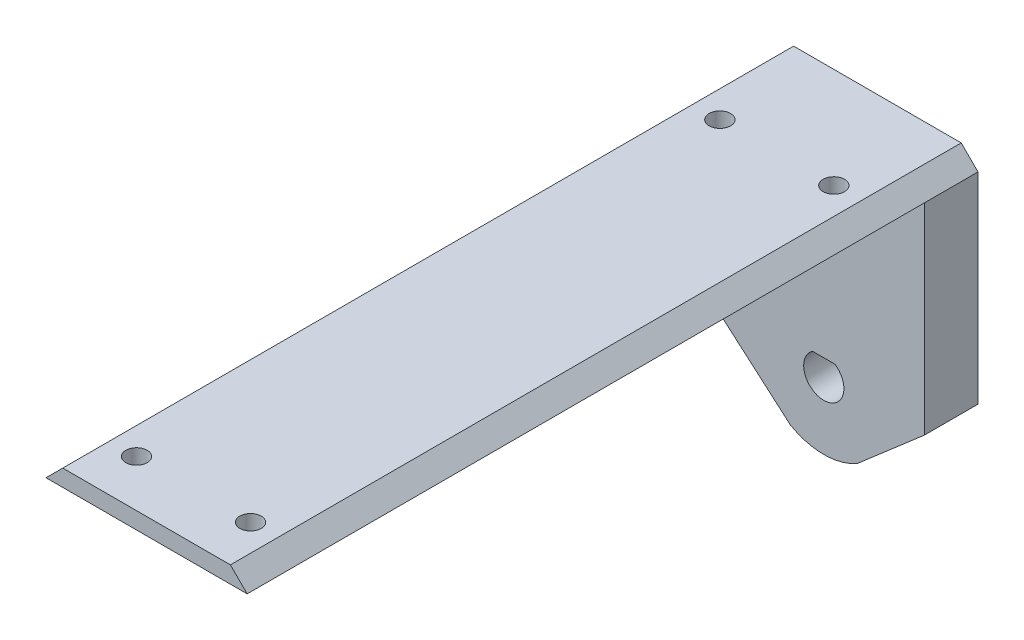
ISO-10303-21;
HEADER;
FILE_DESCRIPTION(('STEP AP214'),'2;1');
FILE_NAME('part.step','',(''),(''),'','','');
FILE_SCHEMA(('AUTOMOTIVE_DESIGN { 1 0 10303 214 1 1 1 1 }'));
ENDSEC;
DATA;
#1=APPLICATION_CONTEXT('core data for automotive mechanical design processes');
#2=APPLICATION_PROTOCOL_DEFINITION('international standard','automotive_design',2000,#1);
#3=PRODUCT_CONTEXT('',#1,'mechanical');
#4=PRODUCT('Part','Part','',(#3));
#5=PRODUCT_RELATED_PRODUCT_CATEGORY('part','',(#4));
#6=PRODUCT_DEFINITION_FORMATION('','',#4);
#7=PRODUCT_DEFINITION_CONTEXT('part definition',#1,'design');
#8=PRODUCT_DEFINITION('design','',#6,#7);
#9=PRODUCT_DEFINITION_SHAPE('','',#8);
#10=(LENGTH_UNIT() NAMED_UNIT(*) SI_UNIT(.MILLI.,.METRE.));
#11=(NAMED_UNIT(*) PLANE_ANGLE_UNIT() SI_UNIT($,.RADIAN.));
#12=(NAMED_UNIT(*) SI_UNIT($,.STERADIAN.) SOLID_ANGLE_UNIT());
#13=UNCERTAINTY_MEASURE_WITH_UNIT(LENGTH_MEASURE(1.E-05),#10,'distance_accuracy_value','');
#14=(GEOMETRIC_REPRESENTATION_CONTEXT(3) GLOBAL_UNCERTAINTY_ASSIGNED_CONTEXT((#13)) GLOBAL_UNIT_ASSIGNED_CONTEXT((#10,
#11,#12)) REPRESENTATION_CONTEXT('',''));
#15=CARTESIAN_POINT('',(0.,0.,0.));
#16=DIRECTION('',(0.,0.,1.));
#17=DIRECTION('',(1.,0.,0.));
#18=AXIS2_PLACEMENT_3D('',#15,#16,#17);
#19=CARTESIAN_POINT('',(0.,-7.,8.));
#20=DIRECTION('',(0.,0.,-1.));
#21=DIRECTION('',(-1.,0.,0.));
#22=AXIS2_PLACEMENT_3D('',#19,#20,#21);
#23=CYLINDRICAL_SURFACE('',#22,3.);
#24=CARTESIAN_POINT('',(0.,-7.,0.));
#25=DIRECTION('',(0.,0.,1.));
#26=DIRECTION('',(1.,0.,0.));
#27=AXIS2_PLACEMENT_3D('',#24,#25,#26);
#28=CIRCLE('',#27,3.);
#29=CARTESIAN_POINT('',(-1.6583123951777,-4.5,0.));
#30=VERTEX_POINT('',#29);
#31=CARTESIAN_POINT('',(1.6583123951777,-4.5,0.));
#32=VERTEX_POINT('',#31);
#33=EDGE_CURVE('E146',#30,#32,#28,.T.);
#34=ORIENTED_EDGE('',*,*,#33,.F.);
#35=DIRECTION('',(0.,0.,-1.));
#36=VECTOR('',#35,1.);
#37=CARTESIAN_POINT('',(-1.6583123951777,-4.5,8.));
#38=LINE('',#37,#36);
#39=CARTESIAN_POINT('',(-1.6583123951777,-4.5,8.));
#40=VERTEX_POINT('',#39);
#41=EDGE_CURVE('E11',#40,#30,#38,.T.);
#42=ORIENTED_EDGE('',*,*,#41,.F.);
#43=CARTESIAN_POINT('',(0.,-7.,8.));
#44=DIRECTION('',(0.,0.,1.));
#45=DIRECTION('',(1.,0.,0.));
#46=AXIS2_PLACEMENT_3D('',#43,#44,#45);
#47=CIRCLE('',#46,3.);
#48=CARTESIAN_POINT('',(1.6583123951777,-4.5,8.));
#49=VERTEX_POINT('',#48);
#50=EDGE_CURVE('E123',#40,#49,#47,.T.);
#51=ORIENTED_EDGE('',*,*,#50,.T.);
#52=DIRECTION('',(0.,0.,-1.));
#53=VECTOR('',#52,1.);
#54=CARTESIAN_POINT('',(1.6583123951777,-4.5,8.));
#55=LINE('',#54,#53);
#56=EDGE_CURVE('E46',#49,#32,#55,.T.);
#57=ORIENTED_EDGE('',*,*,#56,.T.);
#58=EDGE_LOOP('',(#34,#42,#51,#57));
#59=FACE_BOUND('',#58,.T.);
#60=ADVANCED_FACE('F36',(#59),#23,.F.);
#61=CARTESIAN_POINT('',(0.,-7.,8.));
#62=DIRECTION('',(0.,0.,-1.));
#63=DIRECTION('',(-1.,0.,0.));
#64=AXIS2_PLACEMENT_3D('',#61,#62,#63);
#65=CYLINDRICAL_SURFACE('',#64,10.);
#66=CARTESIAN_POINT('',(0.,-7.,0.));
#67=DIRECTION('',(0.,0.,1.));
#68=DIRECTION('',(1.,0.,0.));
#69=AXIS2_PLACEMENT_3D('',#66,#67,#68);
#70=CIRCLE('',#69,10.);
#71=CARTESIAN_POINT('',(5.,-15.6602540378444,0.));
#72=VERTEX_POINT('',#71);
#73=CARTESIAN_POINT('',(-5.,-15.6602540378444,0.));
#74=VERTEX_POINT('',#73);
#75=EDGE_CURVE('E133',#72,#74,#70,.F.);
#76=ORIENTED_EDGE('',*,*,#75,.F.);
#77=DIRECTION('',(0.,0.,-1.));
#78=VECTOR('',#77,1.);
#79=CARTESIAN_POINT('',(5.,-15.6602540378444,8.));
#80=LINE('',#79,#78);
#81=CARTESIAN_POINT('',(5.,-15.6602540378444,8.));
#82=VERTEX_POINT('',#81);
#83=EDGE_CURVE('E84',#82,#72,#80,.T.);
#84=ORIENTED_EDGE('',*,*,#83,.F.);
#85=CARTESIAN_POINT('',(0.,-7.,8.));
#86=DIRECTION('',(0.,0.,1.));
#87=DIRECTION('',(1.,0.,0.));
#88=AXIS2_PLACEMENT_3D('',#85,#86,#87);
#89=CIRCLE('',#88,10.);
#90=CARTESIAN_POINT('',(-5.,-15.6602540378444,8.));
#91=VERTEX_POINT('',#90);
#92=EDGE_CURVE('E110',#82,#91,#89,.F.);
#93=ORIENTED_EDGE('',*,*,#92,.T.);
#94=DIRECTION('',(0.,0.,-1.));
#95=VECTOR('',#94,1.);
#96=CARTESIAN_POINT('',(-5.,-15.6602540378444,8.));
#97=LINE('',#96,#95);
#98=EDGE_CURVE('E100',#91,#74,#97,.T.);
#99=ORIENTED_EDGE('',*,*,#98,.T.);
#100=EDGE_LOOP('',(#76,#84,#93,#99));
#101=FACE_BOUND('',#100,.T.);
#102=ADVANCED_FACE('F38',(#101),#65,.T.);
#103=CARTESIAN_POINT('',(9.89267304370918,-11.4230748895809,8.));
#104=DIRECTION('',(0.654653670707977,-0.755928946018455,0.));
#105=DIRECTION('',(0.755928946018455,0.654653670707977,0.));
#106=AXIS2_PLACEMENT_3D('',#103,#104,#105);
#107=PLANE('',#106);
#108=DIRECTION('',(-0.755928946018455,-0.654653670707977,0.));
#109=VECTOR('',#108,1.);
#110=CARTESIAN_POINT('',(9.89267304370918,-11.4230748895809,0.));
#111=LINE('',#110,#109);
#112=CARTESIAN_POINT('',(15.,-7.,0.));
#113=VERTEX_POINT('',#112);
#114=EDGE_CURVE('E135',#113,#72,#111,.T.);
#115=ORIENTED_EDGE('',*,*,#114,.F.);
#116=DIRECTION('',(0.,0.,-1.));
#117=VECTOR('',#116,1.);
#118=CARTESIAN_POINT('',(15.,-7.,8.));
#119=LINE('',#118,#117);
#120=CARTESIAN_POINT('',(15.,-7.,8.));
#121=VERTEX_POINT('',#120);
#122=EDGE_CURVE('E153',#121,#113,#119,.T.);
#123=ORIENTED_EDGE('',*,*,#122,.F.);
#124=DIRECTION('',(-0.755928946018455,-0.654653670707977,0.));
#125=VECTOR('',#124,1.);
#126=CARTESIAN_POINT('',(9.89267304370918,-11.4230748895809,8.));
#127=LINE('',#126,#125);
#128=EDGE_CURVE('E114',#121,#82,#127,.T.);
#129=ORIENTED_EDGE('',*,*,#128,.T.);
#130=ORIENTED_EDGE('',*,*,#83,.T.);
#131=EDGE_LOOP('',(#115,#123,#129,#130));
#132=FACE_BOUND('',#131,.T.);
#133=ADVANCED_FACE('F232',(#132),#107,.T.);
#134=CARTESIAN_POINT('',(15.,0.,8.));
#135=DIRECTION('',(-1.,0.,0.));
#136=DIRECTION('',(0.,0.,1.));
#137=AXIS2_PLACEMENT_3D('',#134,#135,#136);
#138=PLANE('',#137);
#139=DIRECTION('',(0.,1.,0.));
#140=VECTOR('',#139,1.);
#141=CARTESIAN_POINT('',(15.,0.,0.));
#142=LINE('',#141,#140);
#143=CARTESIAN_POINT('',(15.,23.,0.));
#144=VERTEX_POINT('',#143);
#145=EDGE_CURVE('E139',#113,#144,#142,.T.);
#146=ORIENTED_EDGE('',*,*,#145,.T.);
#147=DIRECTION('',(0.,0.,-1.));
#148=VECTOR('',#147,1.);
#149=CARTESIAN_POINT('',(15.,23.,8.));
#150=LINE('',#149,#148);
#151=CARTESIAN_POINT('',(15.,23.,7.99999999999999));
#152=VERTEX_POINT('',#151);
#153=EDGE_CURVE('E155',#152,#144,#150,.T.);
#154=ORIENTED_EDGE('',*,*,#153,.F.);
#155=DIRECTION('',(0.,1.,0.));
#156=VECTOR('',#155,1.);
#157=CARTESIAN_POINT('',(15.,0.,8.));
#158=LINE('',#157,#156);
#159=EDGE_CURVE('E158',#121,#152,#158,.T.);
#160=ORIENTED_EDGE('',*,*,#159,.F.);
#161=ORIENTED_EDGE('',*,*,#122,.T.);
#162=EDGE_LOOP('',(#146,#154,#160,#161));
#163=FACE_BOUND('',#162,.T.);
#164=ADVANCED_FACE('F238',(#163),#138,.F.);
#165=CARTESIAN_POINT('',(-15.,0.,8.));
#166=DIRECTION('',(-1.,0.,0.));
#167=DIRECTION('',(0.,0.,1.));
#168=AXIS2_PLACEMENT_3D('',#165,#166,#167);
#169=PLANE('',#168);
#170=DIRECTION('',(0.,1.,0.));
#171=VECTOR('',#170,1.);
#172=CARTESIAN_POINT('',(-15.,0.,0.));
#173=LINE('',#172,#171);
#174=CARTESIAN_POINT('',(-15.,-7.,0.));
#175=VERTEX_POINT('',#174);
#176=CARTESIAN_POINT('',(-15.,23.,0.));
#177=VERTEX_POINT('',#176);
#178=EDGE_CURVE('E142',#175,#177,#173,.T.);
#179=ORIENTED_EDGE('',*,*,#178,.F.);
#180=DIRECTION('',(0.,0.,-1.));
#181=VECTOR('',#180,1.);
#182=CARTESIAN_POINT('',(-15.,-7.,8.));
#183=LINE('',#182,#181);
#184=CARTESIAN_POINT('',(-15.,-7.,8.));
#185=VERTEX_POINT('',#184);
#186=EDGE_CURVE('E107',#185,#175,#183,.T.);
#187=ORIENTED_EDGE('',*,*,#186,.F.);
#188=DIRECTION('',(0.,1.,0.));
#189=VECTOR('',#188,1.);
#190=CARTESIAN_POINT('',(-15.,0.,8.));
#191=LINE('',#190,#189);
#192=CARTESIAN_POINT('',(-15.,23.,8.));
#193=VERTEX_POINT('',#192);
#194=EDGE_CURVE('E122',#185,#193,#191,.T.);
#195=ORIENTED_EDGE('',*,*,#194,.T.);
#196=DIRECTION('',(0.,0.,-1.));
#197=VECTOR('',#196,1.);
#198=CARTESIAN_POINT('',(-15.,23.,8.));
#199=LINE('',#198,#197);
#200=EDGE_CURVE('E152',#193,#177,#199,.T.);
#201=ORIENTED_EDGE('',*,*,#200,.T.);
#202=EDGE_LOOP('',(#179,#187,#195,#201));
#203=FACE_BOUND('',#202,.T.);
#204=ADVANCED_FACE('F304',(#203),#169,.T.);
#205=CARTESIAN_POINT('',(-9.89267304370918,-11.4230748895809,8.));
#206=DIRECTION('',(-0.654653670707977,-0.755928946018455,0.));
#207=DIRECTION('',(0.755928946018455,-0.654653670707977,0.));
#208=AXIS2_PLACEMENT_3D('',#205,#206,#207);
#209=PLANE('',#208);
#210=DIRECTION('',(-0.755928946018455,0.654653670707977,0.));
#211=VECTOR('',#210,1.);
#212=CARTESIAN_POINT('',(-9.89267304370918,-11.4230748895809,0.));
#213=LINE('',#212,#211);
#214=EDGE_CURVE('E105',#74,#175,#213,.T.);
#215=ORIENTED_EDGE('',*,*,#214,.F.);
#216=ORIENTED_EDGE('',*,*,#98,.F.);
#217=DIRECTION('',(-0.755928946018455,0.654653670707977,0.));
#218=VECTOR('',#217,1.);
#219=CARTESIAN_POINT('',(-9.89267304370918,-11.4230748895809,8.));
#220=LINE('',#219,#218);
#221=EDGE_CURVE('E103',#91,#185,#220,.T.);
#222=ORIENTED_EDGE('',*,*,#221,.T.);
#223=ORIENTED_EDGE('',*,*,#186,.T.);
#224=EDGE_LOOP('',(#215,#216,#222,#223));
#225=FACE_BOUND('',#224,.T.);
#226=ADVANCED_FACE('F101',(#225),#209,.T.);
#227=CARTESIAN_POINT('',(0.,-4.5,8.));
#228=DIRECTION('',(0.,-1.,0.));
#229=DIRECTION('',(0.,0.,-1.));
#230=AXIS2_PLACEMENT_3D('',#227,#228,#229);
#231=PLANE('',#230);
#232=DIRECTION('',(-1.,0.,0.));
#233=VECTOR('',#232,1.);
#234=CARTESIAN_POINT('',(0.,-4.5,0.));
#235=LINE('',#234,#233);
#236=EDGE_CURVE('E115',#32,#30,#235,.T.);
#237=ORIENTED_EDGE('',*,*,#236,.F.);
#238=ORIENTED_EDGE('',*,*,#56,.F.);
#239=DIRECTION('',(-1.,0.,0.));
#240=VECTOR('',#239,1.);
#241=CARTESIAN_POINT('',(0.,-4.5,8.));
#242=LINE('',#241,#240);
#243=EDGE_CURVE('E108',#49,#40,#242,.T.);
#244=ORIENTED_EDGE('',*,*,#243,.T.);
#245=ORIENTED_EDGE('',*,*,#41,.T.);
#246=EDGE_LOOP('',(#237,#238,#244,#245));
#247=FACE_BOUND('',#246,.T.);
#248=ADVANCED_FACE('F301',(#247),#231,.T.);
#249=CARTESIAN_POINT('',(0.,0.,8.));
#250=DIRECTION('',(0.,0.,1.));
#251=DIRECTION('',(1.,0.,0.));
#252=AXIS2_PLACEMENT_3D('',#249,#250,#251);
#253=PLANE('',#252);
#254=ORIENTED_EDGE('',*,*,#92,.F.);
#255=ORIENTED_EDGE('',*,*,#128,.F.);
#256=ORIENTED_EDGE('',*,*,#159,.T.);
#257=DIRECTION('',(-1.,0.,0.));
#258=VECTOR('',#257,1.);
#259=CARTESIAN_POINT('',(0.,23.,8.));
#260=LINE('',#259,#258);
#261=EDGE_CURVE('E126',#152,#193,#260,.T.);
#262=ORIENTED_EDGE('',*,*,#261,.T.);
#263=ORIENTED_EDGE('',*,*,#194,.F.);
#264=ORIENTED_EDGE('',*,*,#221,.F.);
#265=EDGE_LOOP('',(#254,#255,#256,#262,#263,#264));
#266=FACE_BOUND('',#265,.T.);
#267=ORIENTED_EDGE('',*,*,#50,.F.);
#268=ORIENTED_EDGE('',*,*,#243,.F.);
#269=EDGE_LOOP('',(#267,#268));
#270=FACE_BOUND('',#269,.T.);
#271=ADVANCED_FACE('F118',(#266,#270),#253,.T.);
#272=CARTESIAN_POINT('',(0.,0.,0.));
#273=DIRECTION('',(0.,0.,1.));
#274=DIRECTION('',(1.,0.,0.));
#275=AXIS2_PLACEMENT_3D('',#272,#273,#274);
#276=PLANE('',#275);
#277=ORIENTED_EDGE('',*,*,#75,.T.);
#278=ORIENTED_EDGE('',*,*,#214,.T.);
#279=ORIENTED_EDGE('',*,*,#178,.T.);
#280=DIRECTION('',(0.707106781186546,0.707106781186549,0.));
#281=VECTOR('',#280,1.);
#282=CARTESIAN_POINT('',(-19.,18.9999999999999,0.));
#283=LINE('',#282,#281);
#284=CARTESIAN_POINT('',(-12.5,25.5,0.));
#285=VERTEX_POINT('',#284);
#286=EDGE_CURVE('E214',#177,#285,#283,.T.);
#287=ORIENTED_EDGE('',*,*,#286,.T.);
#288=DIRECTION('',(1.,0.,0.));
#289=VECTOR('',#288,1.);
#290=CARTESIAN_POINT('',(0.,25.5,0.));
#291=LINE('',#290,#289);
#292=CARTESIAN_POINT('',(12.5,25.5,0.));
#293=VERTEX_POINT('',#292);
#294=EDGE_CURVE('E197',#285,#293,#291,.T.);
#295=ORIENTED_EDGE('',*,*,#294,.T.);
#296=DIRECTION('',(-0.707106781186552,0.707106781186543,0.));
#297=VECTOR('',#296,1.);
#298=CARTESIAN_POINT('',(18.9999999999999,19.0000000000001,0.));
#299=LINE('',#298,#297);
#300=EDGE_CURVE('E202',#144,#293,#299,.T.);
#301=ORIENTED_EDGE('',*,*,#300,.F.);
#302=ORIENTED_EDGE('',*,*,#145,.F.);
#303=ORIENTED_EDGE('',*,*,#114,.T.);
#304=EDGE_LOOP('',(#277,#278,#279,#287,#295,#301,#302,#303));
#305=FACE_BOUND('',#304,.T.);
#306=ORIENTED_EDGE('',*,*,#33,.T.);
#307=ORIENTED_EDGE('',*,*,#236,.T.);
#308=EDGE_LOOP('',(#306,#307));
#309=FACE_BOUND('',#308,.T.);
#310=ADVANCED_FACE('F251',(#305,#309),#276,.F.);
#311=CARTESIAN_POINT('',(0.,23.,109.));
#312=DIRECTION('',(0.,-1.,0.));
#313=DIRECTION('',(0.,0.,-1.));
#314=AXIS2_PLACEMENT_3D('',#311,#312,#313);
#315=PLANE('',#314);
#316=CARTESIAN_POINT('',(-8.50000000000001,23.,15.));
#317=DIRECTION('',(0.,-1.,0.));
#318=DIRECTION('',(0.,0.,-1.));
#319=AXIS2_PLACEMENT_3D('',#316,#317,#318);
#320=CIRCLE('',#319,1.59999999999999);
#321=CARTESIAN_POINT('',(-8.50000000000001,23.,13.4));
#322=VERTEX_POINT('',#321);
#323=EDGE_CURVE('E40',#322,#322,#320,.T.);
#324=ORIENTED_EDGE('',*,*,#323,.F.);
#325=EDGE_LOOP('',(#324));
#326=FACE_BOUND('',#325,.T.);
#327=CARTESIAN_POINT('',(8.49999999999998,23.,15.));
#328=DIRECTION('',(0.,-1.,0.));
#329=DIRECTION('',(0.,0.,-1.));
#330=AXIS2_PLACEMENT_3D('',#327,#328,#329);
#331=CIRCLE('',#330,1.59999999999999);
#332=CARTESIAN_POINT('',(8.49999999999998,23.,13.4));
#333=VERTEX_POINT('',#332);
#334=EDGE_CURVE('E177',#333,#333,#331,.T.);
#335=ORIENTED_EDGE('',*,*,#334,.F.);
#336=EDGE_LOOP('',(#335));
#337=FACE_BOUND('',#336,.T.);
#338=CARTESIAN_POINT('',(-8.5,23.,102.));
#339=DIRECTION('',(0.,-1.,0.));
#340=DIRECTION('',(0.,0.,-1.));
#341=AXIS2_PLACEMENT_3D('',#338,#339,#340);
#342=CIRCLE('',#341,1.59999999999999);
#343=CARTESIAN_POINT('',(-8.5,23.,100.4));
#344=VERTEX_POINT('',#343);
#345=EDGE_CURVE('E173',#344,#344,#342,.T.);
#346=ORIENTED_EDGE('',*,*,#345,.F.);
#347=EDGE_LOOP('',(#346));
#348=FACE_BOUND('',#347,.T.);
#349=CARTESIAN_POINT('',(8.49999999999998,23.,102.));
#350=DIRECTION('',(0.,-1.,0.));
#351=DIRECTION('',(0.,0.,-1.));
#352=AXIS2_PLACEMENT_3D('',#349,#350,#351);
#353=CIRCLE('',#352,1.59999999999999);
#354=CARTESIAN_POINT('',(8.49999999999998,23.,100.4));
#355=VERTEX_POINT('',#354);
#356=EDGE_CURVE('E194',#355,#355,#353,.T.);
#357=ORIENTED_EDGE('',*,*,#356,.F.);
#358=EDGE_LOOP('',(#357));
#359=FACE_BOUND('',#358,.T.);
#360=ORIENTED_EDGE('',*,*,#261,.F.);
#361=DIRECTION('',(0.,0.,-1.));
#362=VECTOR('',#361,1.);
#363=CARTESIAN_POINT('',(15.,23.,109.));
#364=LINE('',#363,#362);
#365=CARTESIAN_POINT('',(15.,23.,109.));
#366=VERTEX_POINT('',#365);
#367=EDGE_CURVE('E221',#366,#152,#364,.T.);
#368=ORIENTED_EDGE('',*,*,#367,.F.);
#369=DIRECTION('',(-1.,0.,0.));
#370=VECTOR('',#369,1.);
#371=CARTESIAN_POINT('',(0.,23.,109.));
#372=LINE('',#371,#370);
#373=CARTESIAN_POINT('',(-15.,23.,109.));
#374=VERTEX_POINT('',#373);
#375=EDGE_CURVE('E205',#366,#374,#372,.T.);
#376=ORIENTED_EDGE('',*,*,#375,.T.);
#377=DIRECTION('',(0.,0.,-1.));
#378=VECTOR('',#377,1.);
#379=CARTESIAN_POINT('',(-15.,23.,109.));
#380=LINE('',#379,#378);
#381=EDGE_CURVE('E229',#374,#193,#380,.T.);
#382=ORIENTED_EDGE('',*,*,#381,.T.);
#383=EDGE_LOOP('',(#360,#368,#376,#382));
#384=FACE_BOUND('',#383,.T.);
#385=ADVANCED_FACE('F279',(#326,#337,#348,#359,#384),#315,.T.);
#386=CARTESIAN_POINT('',(0.,25.5,109.));
#387=DIRECTION('',(0.,1.,0.));
#388=DIRECTION('',(0.,0.,1.));
#389=AXIS2_PLACEMENT_3D('',#386,#387,#388);
#390=PLANE('',#389);
#391=CARTESIAN_POINT('',(-8.50000000000001,25.5,15.));
#392=DIRECTION('',(0.,1.,0.));
#393=DIRECTION('',(0.,0.,1.));
#394=AXIS2_PLACEMENT_3D('',#391,#392,#393);
#395=CIRCLE('',#394,1.59999999999999);
#396=CARTESIAN_POINT('',(-8.50000000000001,25.5,16.6));
#397=VERTEX_POINT('',#396);
#398=EDGE_CURVE('E189',#397,#397,#395,.T.);
#399=ORIENTED_EDGE('',*,*,#398,.F.);
#400=EDGE_LOOP('',(#399));
#401=FACE_BOUND('',#400,.T.);
#402=CARTESIAN_POINT('',(8.49999999999998,25.5,15.));
#403=DIRECTION('',(0.,1.,0.));
#404=DIRECTION('',(0.,0.,1.));
#405=AXIS2_PLACEMENT_3D('',#402,#403,#404);
#406=CIRCLE('',#405,1.59999999999999);
#407=CARTESIAN_POINT('',(8.49999999999998,25.5,16.6));
#408=VERTEX_POINT('',#407);
#409=EDGE_CURVE('E179',#408,#408,#406,.T.);
#410=ORIENTED_EDGE('',*,*,#409,.F.);
#411=EDGE_LOOP('',(#410));
#412=FACE_BOUND('',#411,.T.);
#413=CARTESIAN_POINT('',(-8.5,25.5,102.));
#414=DIRECTION('',(0.,1.,0.));
#415=DIRECTION('',(0.,0.,1.));
#416=AXIS2_PLACEMENT_3D('',#413,#414,#415);
#417=CIRCLE('',#416,1.59999999999999);
#418=CARTESIAN_POINT('',(-8.5,25.5,103.6));
#419=VERTEX_POINT('',#418);
#420=EDGE_CURVE('E176',#419,#419,#417,.T.);
#421=ORIENTED_EDGE('',*,*,#420,.F.);
#422=EDGE_LOOP('',(#421));
#423=FACE_BOUND('',#422,.T.);
#424=CARTESIAN_POINT('',(8.49999999999998,25.5,102.));
#425=DIRECTION('',(0.,1.,0.));
#426=DIRECTION('',(0.,0.,1.));
#427=AXIS2_PLACEMENT_3D('',#424,#425,#426);
#428=CIRCLE('',#427,1.59999999999999);
#429=CARTESIAN_POINT('',(8.49999999999998,25.5,103.6));
#430=VERTEX_POINT('',#429);
#431=EDGE_CURVE('E175',#430,#430,#428,.T.);
#432=ORIENTED_EDGE('',*,*,#431,.F.);
#433=EDGE_LOOP('',(#432));
#434=FACE_BOUND('',#433,.T.);
#435=ORIENTED_EDGE('',*,*,#294,.F.);
#436=DIRECTION('',(0.,0.,-1.));
#437=VECTOR('',#436,1.);
#438=CARTESIAN_POINT('',(-12.5,25.5,109.));
#439=LINE('',#438,#437);
#440=CARTESIAN_POINT('',(-12.5,25.5,109.));
#441=VERTEX_POINT('',#440);
#442=EDGE_CURVE('E136',#441,#285,#439,.T.);
#443=ORIENTED_EDGE('',*,*,#442,.F.);
#444=DIRECTION('',(1.,0.,0.));
#445=VECTOR('',#444,1.);
#446=CARTESIAN_POINT('',(0.,25.5,109.));
#447=LINE('',#446,#445);
#448=CARTESIAN_POINT('',(12.5,25.5,109.));
#449=VERTEX_POINT('',#448);
#450=EDGE_CURVE('E198',#441,#449,#447,.T.);
#451=ORIENTED_EDGE('',*,*,#450,.T.);
#452=DIRECTION('',(0.,0.,-1.));
#453=VECTOR('',#452,1.);
#454=CARTESIAN_POINT('',(12.5,25.5,109.));
#455=LINE('',#454,#453);
#456=EDGE_CURVE('E211',#449,#293,#455,.T.);
#457=ORIENTED_EDGE('',*,*,#456,.T.);
#458=EDGE_LOOP('',(#435,#443,#451,#457));
#459=FACE_BOUND('',#458,.T.);
#460=ADVANCED_FACE('F259',(#401,#412,#423,#434,#459),#390,.T.);
#461=CARTESIAN_POINT('',(-19.,18.9999999999999,109.));
#462=DIRECTION('',(-0.707106781186549,0.707106781186546,0.));
#463=DIRECTION('',(-0.707106781186546,-0.707106781186549,0.));
#464=AXIS2_PLACEMENT_3D('',#461,#462,#463);
#465=PLANE('',#464);
#466=ORIENTED_EDGE('',*,*,#286,.F.);
#467=ORIENTED_EDGE('',*,*,#200,.F.);
#468=ORIENTED_EDGE('',*,*,#381,.F.);
#469=DIRECTION('',(0.707106781186546,0.707106781186549,0.));
#470=VECTOR('',#469,1.);
#471=CARTESIAN_POINT('',(-19.,18.9999999999999,109.));
#472=LINE('',#471,#470);
#473=EDGE_CURVE('E201',#374,#441,#472,.T.);
#474=ORIENTED_EDGE('',*,*,#473,.T.);
#475=ORIENTED_EDGE('',*,*,#442,.T.);
#476=EDGE_LOOP('',(#466,#467,#468,#474,#475));
#477=FACE_BOUND('',#476,.T.);
#478=ADVANCED_FACE('F274',(#477),#465,.T.);
#479=CARTESIAN_POINT('',(18.9999999999999,19.0000000000001,109.));
#480=DIRECTION('',(-0.707106781186543,-0.707106781186552,0.));
#481=DIRECTION('',(0.707106781186552,-0.707106781186543,0.));
#482=AXIS2_PLACEMENT_3D('',#479,#480,#481);
#483=PLANE('',#482);
#484=ORIENTED_EDGE('',*,*,#300,.T.);
#485=ORIENTED_EDGE('',*,*,#456,.F.);
#486=DIRECTION('',(-0.707106781186552,0.707106781186543,0.));
#487=VECTOR('',#486,1.);
#488=CARTESIAN_POINT('',(18.9999999999999,19.0000000000001,109.));
#489=LINE('',#488,#487);
#490=EDGE_CURVE('E208',#366,#449,#489,.T.);
#491=ORIENTED_EDGE('',*,*,#490,.F.);
#492=ORIENTED_EDGE('',*,*,#367,.T.);
#493=ORIENTED_EDGE('',*,*,#153,.T.);
#494=EDGE_LOOP('',(#484,#485,#491,#492,#493));
#495=FACE_BOUND('',#494,.T.);
#496=ADVANCED_FACE('F243',(#495),#483,.F.);
#497=CARTESIAN_POINT('',(0.,0.,109.));
#498=DIRECTION('',(0.,0.,1.));
#499=DIRECTION('',(1.,0.,0.));
#500=AXIS2_PLACEMENT_3D('',#497,#498,#499);
#501=PLANE('',#500);
#502=ORIENTED_EDGE('',*,*,#450,.F.);
#503=ORIENTED_EDGE('',*,*,#473,.F.);
#504=ORIENTED_EDGE('',*,*,#375,.F.);
#505=ORIENTED_EDGE('',*,*,#490,.T.);
#506=EDGE_LOOP('',(#502,#503,#504,#505));
#507=FACE_BOUND('',#506,.T.);
#508=ADVANCED_FACE('F278',(#507),#501,.T.);
#509=CARTESIAN_POINT('',(8.49999999999998,25.5,102.));
#510=DIRECTION('',(0.,1.,0.));
#511=DIRECTION('',(0.,0.,1.));
#512=AXIS2_PLACEMENT_3D('',#509,#510,#511);
#513=CYLINDRICAL_SURFACE('',#512,1.59999999999999);
#514=ORIENTED_EDGE('',*,*,#356,.T.);
#515=EDGE_LOOP('',(#514));
#516=FACE_BOUND('',#515,.T.);
#517=ORIENTED_EDGE('',*,*,#431,.T.);
#518=EDGE_LOOP('',(#517));
#519=FACE_BOUND('',#518,.T.);
#520=ADVANCED_FACE('F366',(#516,#519),#513,.F.);
#521=CARTESIAN_POINT('',(-8.5,25.5,102.));
#522=DIRECTION('',(0.,1.,0.));
#523=DIRECTION('',(0.,0.,1.));
#524=AXIS2_PLACEMENT_3D('',#521,#522,#523);
#525=CYLINDRICAL_SURFACE('',#524,1.59999999999999);
#526=ORIENTED_EDGE('',*,*,#345,.T.);
#527=EDGE_LOOP('',(#526));
#528=FACE_BOUND('',#527,.T.);
#529=ORIENTED_EDGE('',*,*,#420,.T.);
#530=EDGE_LOOP('',(#529));
#531=FACE_BOUND('',#530,.T.);
#532=ADVANCED_FACE('F384',(#528,#531),#525,.F.);
#533=CARTESIAN_POINT('',(8.49999999999998,25.5,15.));
#534=DIRECTION('',(0.,1.,0.));
#535=DIRECTION('',(0.,0.,1.));
#536=AXIS2_PLACEMENT_3D('',#533,#534,#535);
#537=CYLINDRICAL_SURFACE('',#536,1.59999999999999);
#538=ORIENTED_EDGE('',*,*,#334,.T.);
#539=EDGE_LOOP('',(#538));
#540=FACE_BOUND('',#539,.T.);
#541=ORIENTED_EDGE('',*,*,#409,.T.);
#542=EDGE_LOOP('',(#541));
#543=FACE_BOUND('',#542,.T.);
#544=ADVANCED_FACE('F394',(#540,#543),#537,.F.);
#545=CARTESIAN_POINT('',(-8.50000000000001,25.5,15.));
#546=DIRECTION('',(0.,1.,0.));
#547=DIRECTION('',(0.,0.,1.));
#548=AXIS2_PLACEMENT_3D('',#545,#546,#547);
#549=CYLINDRICAL_SURFACE('',#548,1.59999999999999);
#550=ORIENTED_EDGE('',*,*,#323,.T.);
#551=EDGE_LOOP('',(#550));
#552=FACE_BOUND('',#551,.T.);
#553=ORIENTED_EDGE('',*,*,#398,.T.);
#554=EDGE_LOOP('',(#553));
#555=FACE_BOUND('',#554,.T.);
#556=ADVANCED_FACE('F404',(#552,#555),#549,.F.);
#557=CLOSED_SHELL('',(#60,#102,#133,#164,#204,#226,#248,#271,#310,#385,#460,#478,#496,#508,#520,
#532,#544,#556));
#558=MANIFOLD_SOLID_BREP('B2',#557);
#559=ADVANCED_BREP_SHAPE_REPRESENTATION('',(#18,#558),#14);
#560=SHAPE_DEFINITION_REPRESENTATION(#9,#559);
ENDSEC;
END-ISO-10303-21;
